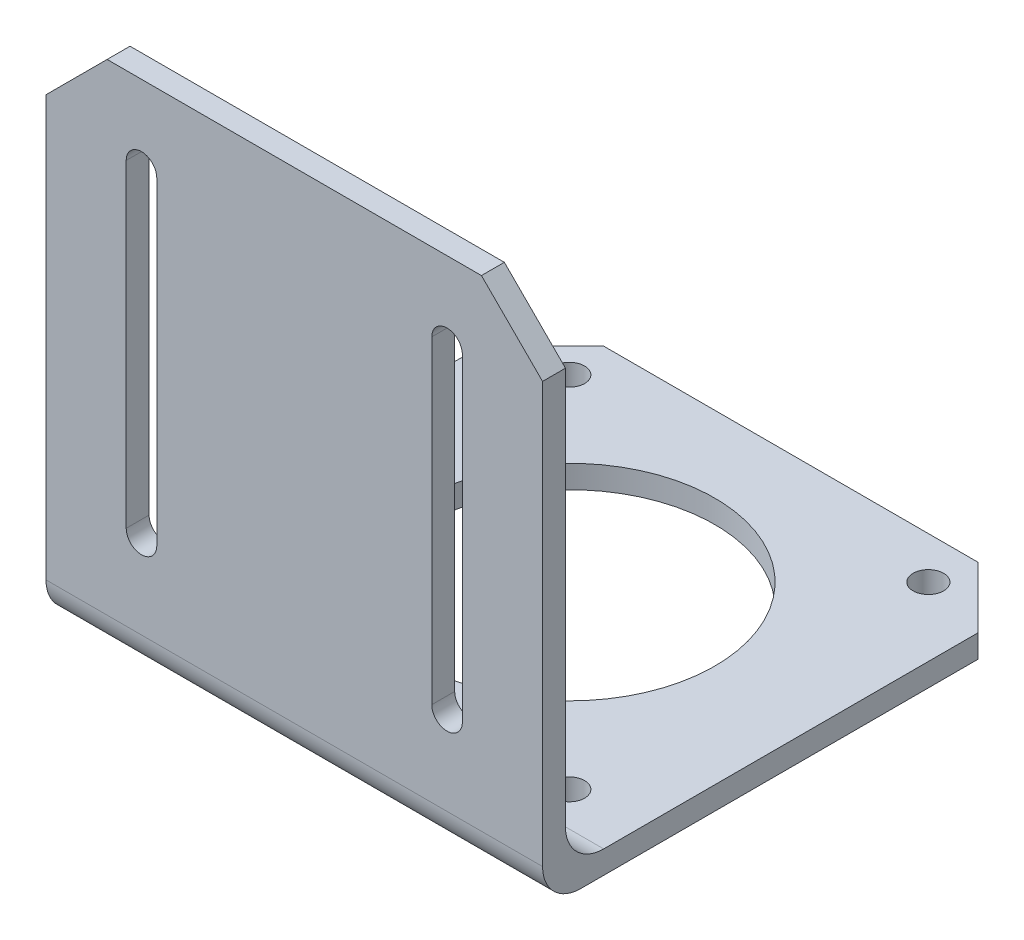
ISO-10303-21;
HEADER;
FILE_DESCRIPTION(('STEP AP214'),'2;1');
FILE_NAME('part.step','',(''),(''),'','','');
FILE_SCHEMA(('AUTOMOTIVE_DESIGN { 1 0 10303 214 1 1 1 1 }'));
ENDSEC;
DATA;
#1=APPLICATION_CONTEXT('core data for automotive mechanical design processes');
#2=APPLICATION_PROTOCOL_DEFINITION('international standard','automotive_design',2000,#1);
#3=PRODUCT_CONTEXT('',#1,'mechanical');
#4=PRODUCT('Part','Part','',(#3));
#5=PRODUCT_RELATED_PRODUCT_CATEGORY('part','',(#4));
#6=PRODUCT_DEFINITION_FORMATION('','',#4);
#7=PRODUCT_DEFINITION_CONTEXT('part definition',#1,'design');
#8=PRODUCT_DEFINITION('design','',#6,#7);
#9=PRODUCT_DEFINITION_SHAPE('','',#8);
#10=(LENGTH_UNIT() NAMED_UNIT(*) SI_UNIT(.MILLI.,.METRE.));
#11=(NAMED_UNIT(*) PLANE_ANGLE_UNIT() SI_UNIT($,.RADIAN.));
#12=(NAMED_UNIT(*) SI_UNIT($,.STERADIAN.) SOLID_ANGLE_UNIT());
#13=UNCERTAINTY_MEASURE_WITH_UNIT(LENGTH_MEASURE(1.E-05),#10,'distance_accuracy_value','');
#14=(GEOMETRIC_REPRESENTATION_CONTEXT(3) GLOBAL_UNCERTAINTY_ASSIGNED_CONTEXT((#13)) GLOBAL_UNIT_ASSIGNED_CONTEXT((#10,
#11,#12)) REPRESENTATION_CONTEXT('',''));
#15=CARTESIAN_POINT('',(0.,0.,0.));
#16=DIRECTION('',(0.,0.,1.));
#17=DIRECTION('',(1.,0.,0.));
#18=AXIS2_PLACEMENT_3D('',#15,#16,#17);
#19=CARTESIAN_POINT('',(0.,3.,0.));
#20=DIRECTION('',(0.,1.,0.));
#21=DIRECTION('',(0.,0.,1.));
#22=AXIS2_PLACEMENT_3D('',#19,#20,#21);
#23=PLANE('',#22);
#24=DIRECTION('',(0.,0.,1.));
#25=VECTOR('',#24,1.);
#26=CARTESIAN_POINT('',(-32.5,3.,-32.5));
#27=LINE('',#26,#25);
#28=CARTESIAN_POINT('',(-32.5,3.,-24.5));
#29=VERTEX_POINT('',#28);
#30=CARTESIAN_POINT('',(-32.5,3.,24.5));
#31=VERTEX_POINT('',#30);
#32=EDGE_CURVE('E285',#29,#31,#27,.T.);
#33=ORIENTED_EDGE('',*,*,#32,.T.);
#34=DIRECTION('',(-1.,0.,0.));
#35=VECTOR('',#34,1.);
#36=CARTESIAN_POINT('',(0.,3.,24.5));
#37=LINE('',#36,#35);
#38=CARTESIAN_POINT('',(32.5,3.,24.5));
#39=VERTEX_POINT('',#38);
#40=EDGE_CURVE('E321',#31,#39,#37,.F.);
#41=ORIENTED_EDGE('',*,*,#40,.T.);
#42=DIRECTION('',(0.,0.,-1.));
#43=VECTOR('',#42,1.);
#44=CARTESIAN_POINT('',(32.5,3.,-32.5));
#45=LINE('',#44,#43);
#46=CARTESIAN_POINT('',(32.5,3.,-24.5));
#47=VERTEX_POINT('',#46);
#48=EDGE_CURVE('E279',#39,#47,#45,.T.);
#49=ORIENTED_EDGE('',*,*,#48,.T.);
#50=DIRECTION('',(0.707106781186546,0.,0.707106781186549));
#51=VECTOR('',#50,1.);
#52=CARTESIAN_POINT('',(28.5000000000001,3.,-28.5));
#53=LINE('',#52,#51);
#54=CARTESIAN_POINT('',(24.5,3.,-32.5));
#55=VERTEX_POINT('',#54);
#56=EDGE_CURVE('E313',#47,#55,#53,.F.);
#57=ORIENTED_EDGE('',*,*,#56,.T.);
#58=DIRECTION('',(-1.,0.,0.));
#59=VECTOR('',#58,1.);
#60=CARTESIAN_POINT('',(-32.5,3.,-32.5));
#61=LINE('',#60,#59);
#62=CARTESIAN_POINT('',(-24.5,3.,-32.5));
#63=VERTEX_POINT('',#62);
#64=EDGE_CURVE('E281',#55,#63,#61,.T.);
#65=ORIENTED_EDGE('',*,*,#64,.T.);
#66=DIRECTION('',(0.707106781186549,0.,-0.707106781186546));
#67=VECTOR('',#66,1.);
#68=CARTESIAN_POINT('',(-28.4999999999999,3.,-28.5));
#69=LINE('',#68,#67);
#70=EDGE_CURVE('E311',#63,#29,#69,.F.);
#71=ORIENTED_EDGE('',*,*,#70,.T.);
#72=EDGE_LOOP('',(#33,#41,#49,#57,#65,#71));
#73=FACE_BOUND('',#72,.T.);
#74=CARTESIAN_POINT('',(23.5,3.,20.));
#75=DIRECTION('',(0.,1.,0.));
#76=DIRECTION('',(0.,0.,1.));
#77=AXIS2_PLACEMENT_3D('',#74,#75,#76);
#78=CIRCLE('',#77,2.);
#79=CARTESIAN_POINT('',(23.5,3.,22.));
#80=VERTEX_POINT('',#79);
#81=EDGE_CURVE('E255',#80,#80,#78,.T.);
#82=ORIENTED_EDGE('',*,*,#81,.F.);
#83=EDGE_LOOP('',(#82));
#84=FACE_BOUND('',#83,.T.);
#85=CARTESIAN_POINT('',(-23.5,3.,-27.));
#86=DIRECTION('',(0.,1.,0.));
#87=DIRECTION('',(0.,0.,1.));
#88=AXIS2_PLACEMENT_3D('',#85,#86,#87);
#89=CIRCLE('',#88,2.);
#90=CARTESIAN_POINT('',(-23.5,3.,-25.));
#91=VERTEX_POINT('',#90);
#92=EDGE_CURVE('E267',#91,#91,#89,.T.);
#93=ORIENTED_EDGE('',*,*,#92,.F.);
#94=EDGE_LOOP('',(#93));
#95=FACE_BOUND('',#94,.T.);
#96=CARTESIAN_POINT('',(0.,3.,-3.5));
#97=DIRECTION('',(0.,1.,0.));
#98=DIRECTION('',(0.,0.,1.));
#99=AXIS2_PLACEMENT_3D('',#96,#97,#98);
#100=CIRCLE('',#99,19.05);
#101=CARTESIAN_POINT('',(0.,3.,15.55));
#102=VERTEX_POINT('',#101);
#103=EDGE_CURVE('E273',#102,#102,#100,.T.);
#104=ORIENTED_EDGE('',*,*,#103,.F.);
#105=EDGE_LOOP('',(#104));
#106=FACE_BOUND('',#105,.T.);
#107=CARTESIAN_POINT('',(-23.5,3.,20.));
#108=DIRECTION('',(0.,1.,0.));
#109=DIRECTION('',(0.,0.,1.));
#110=AXIS2_PLACEMENT_3D('',#107,#108,#109);
#111=CIRCLE('',#110,2.);
#112=CARTESIAN_POINT('',(-23.5,3.,22.));
#113=VERTEX_POINT('',#112);
#114=EDGE_CURVE('E261',#113,#113,#111,.T.);
#115=ORIENTED_EDGE('',*,*,#114,.F.);
#116=EDGE_LOOP('',(#115));
#117=FACE_BOUND('',#116,.T.);
#118=CARTESIAN_POINT('',(23.5,3.,-27.));
#119=DIRECTION('',(0.,1.,0.));
#120=DIRECTION('',(0.,0.,1.));
#121=AXIS2_PLACEMENT_3D('',#118,#119,#120);
#122=CIRCLE('',#121,2.);
#123=CARTESIAN_POINT('',(23.5,3.,-25.));
#124=VERTEX_POINT('',#123);
#125=EDGE_CURVE('E249',#124,#124,#122,.T.);
#126=ORIENTED_EDGE('',*,*,#125,.F.);
#127=EDGE_LOOP('',(#126));
#128=FACE_BOUND('',#127,.T.);
#129=ADVANCED_FACE('F33',(#73,#84,#95,#106,#117,#128),#23,.T.);
#130=CARTESIAN_POINT('',(0.,0.,0.));
#131=DIRECTION('',(0.,1.,0.));
#132=DIRECTION('',(0.,0.,1.));
#133=AXIS2_PLACEMENT_3D('',#130,#131,#132);
#134=PLANE('',#133);
#135=DIRECTION('',(0.,0.,-1.));
#136=VECTOR('',#135,1.);
#137=CARTESIAN_POINT('',(32.5,0.,-32.5));
#138=LINE('',#137,#136);
#139=CARTESIAN_POINT('',(32.5,0.,27.5));
#140=VERTEX_POINT('',#139);
#141=CARTESIAN_POINT('',(32.5,0.,-24.5));
#142=VERTEX_POINT('',#141);
#143=EDGE_CURVE('E276',#140,#142,#138,.T.);
#144=ORIENTED_EDGE('',*,*,#143,.F.);
#145=DIRECTION('',(1.,0.,0.));
#146=VECTOR('',#145,1.);
#147=CARTESIAN_POINT('',(0.,0.,27.5));
#148=LINE('',#147,#146);
#149=CARTESIAN_POINT('',(-32.5,0.,27.5));
#150=VERTEX_POINT('',#149);
#151=EDGE_CURVE('E328',#140,#150,#148,.F.);
#152=ORIENTED_EDGE('',*,*,#151,.T.);
#153=DIRECTION('',(0.,0.,1.));
#154=VECTOR('',#153,1.);
#155=CARTESIAN_POINT('',(-32.5,0.,-32.5));
#156=LINE('',#155,#154);
#157=CARTESIAN_POINT('',(-32.5,0.,-24.5));
#158=VERTEX_POINT('',#157);
#159=EDGE_CURVE('E282',#158,#150,#156,.T.);
#160=ORIENTED_EDGE('',*,*,#159,.F.);
#161=DIRECTION('',(-0.707106781186549,0.,0.707106781186546));
#162=VECTOR('',#161,1.);
#163=CARTESIAN_POINT('',(-32.5,0.,-24.5));
#164=LINE('',#163,#162);
#165=CARTESIAN_POINT('',(-24.5,0.,-32.5));
#166=VERTEX_POINT('',#165);
#167=EDGE_CURVE('E303',#158,#166,#164,.F.);
#168=ORIENTED_EDGE('',*,*,#167,.T.);
#169=DIRECTION('',(-1.,0.,0.));
#170=VECTOR('',#169,1.);
#171=CARTESIAN_POINT('',(-32.5,0.,-32.5));
#172=LINE('',#171,#170);
#173=CARTESIAN_POINT('',(24.5,0.,-32.5));
#174=VERTEX_POINT('',#173);
#175=EDGE_CURVE('E290',#174,#166,#172,.T.);
#176=ORIENTED_EDGE('',*,*,#175,.F.);
#177=DIRECTION('',(-0.707106781186546,0.,-0.707106781186549));
#178=VECTOR('',#177,1.);
#179=CARTESIAN_POINT('',(24.5,0.,-32.5));
#180=LINE('',#179,#178);
#181=EDGE_CURVE('E305',#174,#142,#180,.F.);
#182=ORIENTED_EDGE('',*,*,#181,.T.);
#183=EDGE_LOOP('',(#144,#152,#160,#168,#176,#182));
#184=FACE_BOUND('',#183,.T.);
#185=CARTESIAN_POINT('',(0.,0.,-3.5));
#186=DIRECTION('',(0.,1.,0.));
#187=DIRECTION('',(0.,0.,1.));
#188=AXIS2_PLACEMENT_3D('',#185,#186,#187);
#189=CIRCLE('',#188,19.05);
#190=CARTESIAN_POINT('',(0.,0.,15.55));
#191=VERTEX_POINT('',#190);
#192=EDGE_CURVE('E270',#191,#191,#189,.T.);
#193=ORIENTED_EDGE('',*,*,#192,.T.);
#194=EDGE_LOOP('',(#193));
#195=FACE_BOUND('',#194,.T.);
#196=CARTESIAN_POINT('',(-23.5,0.,-27.));
#197=DIRECTION('',(0.,1.,0.));
#198=DIRECTION('',(0.,0.,1.));
#199=AXIS2_PLACEMENT_3D('',#196,#197,#198);
#200=CIRCLE('',#199,2.);
#201=CARTESIAN_POINT('',(-23.5,0.,-25.));
#202=VERTEX_POINT('',#201);
#203=EDGE_CURVE('E264',#202,#202,#200,.T.);
#204=ORIENTED_EDGE('',*,*,#203,.T.);
#205=EDGE_LOOP('',(#204));
#206=FACE_BOUND('',#205,.T.);
#207=CARTESIAN_POINT('',(-23.5,0.,20.));
#208=DIRECTION('',(0.,1.,0.));
#209=DIRECTION('',(0.,0.,1.));
#210=AXIS2_PLACEMENT_3D('',#207,#208,#209);
#211=CIRCLE('',#210,2.);
#212=CARTESIAN_POINT('',(-23.5,0.,22.));
#213=VERTEX_POINT('',#212);
#214=EDGE_CURVE('E258',#213,#213,#211,.T.);
#215=ORIENTED_EDGE('',*,*,#214,.T.);
#216=EDGE_LOOP('',(#215));
#217=FACE_BOUND('',#216,.T.);
#218=CARTESIAN_POINT('',(23.5,0.,20.));
#219=DIRECTION('',(0.,1.,0.));
#220=DIRECTION('',(0.,0.,1.));
#221=AXIS2_PLACEMENT_3D('',#218,#219,#220);
#222=CIRCLE('',#221,2.);
#223=CARTESIAN_POINT('',(23.5,0.,22.));
#224=VERTEX_POINT('',#223);
#225=EDGE_CURVE('E252',#224,#224,#222,.T.);
#226=ORIENTED_EDGE('',*,*,#225,.T.);
#227=EDGE_LOOP('',(#226));
#228=FACE_BOUND('',#227,.T.);
#229=CARTESIAN_POINT('',(23.5,0.,-27.));
#230=DIRECTION('',(0.,1.,0.));
#231=DIRECTION('',(0.,0.,1.));
#232=AXIS2_PLACEMENT_3D('',#229,#230,#231);
#233=CIRCLE('',#232,2.);
#234=CARTESIAN_POINT('',(23.5,0.,-25.));
#235=VERTEX_POINT('',#234);
#236=EDGE_CURVE('E248',#235,#235,#233,.T.);
#237=ORIENTED_EDGE('',*,*,#236,.T.);
#238=EDGE_LOOP('',(#237));
#239=FACE_BOUND('',#238,.T.);
#240=ADVANCED_FACE('F391',(#184,#195,#206,#217,#228,#239),#134,.F.);
#241=CARTESIAN_POINT('',(32.5,3.,-32.5));
#242=DIRECTION('',(-1.,0.,0.));
#243=DIRECTION('',(0.,0.,1.));
#244=AXIS2_PLACEMENT_3D('',#241,#242,#243);
#245=PLANE('',#244);
#246=DIRECTION('',(0.,-1.,0.));
#247=VECTOR('',#246,1.);
#248=CARTESIAN_POINT('',(32.5,68.,29.5));
#249=LINE('',#248,#247);
#250=CARTESIAN_POINT('',(32.5,60.,29.5));
#251=VERTEX_POINT('',#250);
#252=CARTESIAN_POINT('',(32.5,8.,29.5));
#253=VERTEX_POINT('',#252);
#254=EDGE_CURVE('E246',#251,#253,#249,.T.);
#255=ORIENTED_EDGE('',*,*,#254,.F.);
#256=DIRECTION('',(0.,0.,1.));
#257=VECTOR('',#256,1.);
#258=CARTESIAN_POINT('',(32.5,60.,-32.5));
#259=LINE('',#258,#257);
#260=CARTESIAN_POINT('',(32.5,60.,32.5));
#261=VERTEX_POINT('',#260);
#262=EDGE_CURVE('E348',#251,#261,#259,.T.);
#263=ORIENTED_EDGE('',*,*,#262,.T.);
#264=DIRECTION('',(0.,-1.,0.));
#265=VECTOR('',#264,1.);
#266=CARTESIAN_POINT('',(32.5,3.,32.5));
#267=LINE('',#266,#265);
#268=CARTESIAN_POINT('',(32.5,5.,32.5));
#269=VERTEX_POINT('',#268);
#270=EDGE_CURVE('E288',#261,#269,#267,.T.);
#271=ORIENTED_EDGE('',*,*,#270,.T.);
#272=CARTESIAN_POINT('',(32.5,5.,27.5));
#273=DIRECTION('',(-1.,0.,0.));
#274=DIRECTION('',(0.,0.,1.));
#275=AXIS2_PLACEMENT_3D('',#272,#273,#274);
#276=CIRCLE('',#275,5.);
#277=EDGE_CURVE('E326',#269,#140,#276,.F.);
#278=ORIENTED_EDGE('',*,*,#277,.T.);
#279=ORIENTED_EDGE('',*,*,#143,.T.);
#280=DIRECTION('',(0.,1.,0.));
#281=VECTOR('',#280,1.);
#282=CARTESIAN_POINT('',(32.5,3.,-24.5));
#283=LINE('',#282,#281);
#284=EDGE_CURVE('E308',#142,#47,#283,.T.);
#285=ORIENTED_EDGE('',*,*,#284,.T.);
#286=ORIENTED_EDGE('',*,*,#48,.F.);
#287=CARTESIAN_POINT('',(32.5,8.,24.5));
#288=DIRECTION('',(-1.,0.,0.));
#289=DIRECTION('',(0.,0.,1.));
#290=AXIS2_PLACEMENT_3D('',#287,#288,#289);
#291=CIRCLE('',#290,5.);
#292=EDGE_CURVE('E335',#39,#253,#291,.T.);
#293=ORIENTED_EDGE('',*,*,#292,.T.);
#294=EDGE_LOOP('',(#255,#263,#271,#278,#279,#285,#286,#293));
#295=FACE_BOUND('',#294,.T.);
#296=ADVANCED_FACE('F367',(#295),#245,.F.);
#297=CARTESIAN_POINT('',(-32.5,3.,-32.5));
#298=DIRECTION('',(0.,0.,1.));
#299=DIRECTION('',(1.,0.,0.));
#300=AXIS2_PLACEMENT_3D('',#297,#298,#299);
#301=PLANE('',#300);
#302=ORIENTED_EDGE('',*,*,#64,.F.);
#303=DIRECTION('',(0.,-1.,0.));
#304=VECTOR('',#303,1.);
#305=CARTESIAN_POINT('',(24.5,3.,-32.5));
#306=LINE('',#305,#304);
#307=EDGE_CURVE('E300',#55,#174,#306,.T.);
#308=ORIENTED_EDGE('',*,*,#307,.T.);
#309=ORIENTED_EDGE('',*,*,#175,.T.);
#310=DIRECTION('',(0.,1.,0.));
#311=VECTOR('',#310,1.);
#312=CARTESIAN_POINT('',(-24.5,3.,-32.5));
#313=LINE('',#312,#311);
#314=EDGE_CURVE('E298',#166,#63,#313,.T.);
#315=ORIENTED_EDGE('',*,*,#314,.T.);
#316=EDGE_LOOP('',(#302,#308,#309,#315));
#317=FACE_BOUND('',#316,.T.);
#318=ADVANCED_FACE('F404',(#317),#301,.F.);
#319=CARTESIAN_POINT('',(-32.5,3.,-32.5));
#320=DIRECTION('',(1.,0.,0.));
#321=DIRECTION('',(0.,0.,-1.));
#322=AXIS2_PLACEMENT_3D('',#319,#320,#321);
#323=PLANE('',#322);
#324=DIRECTION('',(0.,-1.,0.));
#325=VECTOR('',#324,1.);
#326=CARTESIAN_POINT('',(-32.5,3.,32.5));
#327=LINE('',#326,#325);
#328=CARTESIAN_POINT('',(-32.5,60.,32.5));
#329=VERTEX_POINT('',#328);
#330=CARTESIAN_POINT('',(-32.5,5.,32.5));
#331=VERTEX_POINT('',#330);
#332=EDGE_CURVE('E296',#329,#331,#327,.T.);
#333=ORIENTED_EDGE('',*,*,#332,.F.);
#334=DIRECTION('',(0.,0.,-1.));
#335=VECTOR('',#334,1.);
#336=CARTESIAN_POINT('',(-32.5,60.,-32.5));
#337=LINE('',#336,#335);
#338=CARTESIAN_POINT('',(-32.5,60.,29.5));
#339=VERTEX_POINT('',#338);
#340=EDGE_CURVE('E11',#329,#339,#337,.T.);
#341=ORIENTED_EDGE('',*,*,#340,.T.);
#342=DIRECTION('',(0.,-1.,0.));
#343=VECTOR('',#342,1.);
#344=CARTESIAN_POINT('',(-32.5,68.,29.5));
#345=LINE('',#344,#343);
#346=CARTESIAN_POINT('',(-32.5,8.,29.5));
#347=VERTEX_POINT('',#346);
#348=EDGE_CURVE('E244',#339,#347,#345,.T.);
#349=ORIENTED_EDGE('',*,*,#348,.T.);
#350=CARTESIAN_POINT('',(-32.5,8.,24.5));
#351=DIRECTION('',(1.,0.,0.));
#352=DIRECTION('',(0.,0.,-1.));
#353=AXIS2_PLACEMENT_3D('',#350,#351,#352);
#354=CIRCLE('',#353,5.);
#355=EDGE_CURVE('E333',#347,#31,#354,.T.);
#356=ORIENTED_EDGE('',*,*,#355,.T.);
#357=ORIENTED_EDGE('',*,*,#32,.F.);
#358=DIRECTION('',(0.,-1.,0.));
#359=VECTOR('',#358,1.);
#360=CARTESIAN_POINT('',(-32.5,3.,-24.5));
#361=LINE('',#360,#359);
#362=EDGE_CURVE('E315',#29,#158,#361,.T.);
#363=ORIENTED_EDGE('',*,*,#362,.T.);
#364=ORIENTED_EDGE('',*,*,#159,.T.);
#365=CARTESIAN_POINT('',(-32.5,5.,27.5));
#366=DIRECTION('',(1.,0.,0.));
#367=DIRECTION('',(0.,0.,-1.));
#368=AXIS2_PLACEMENT_3D('',#365,#366,#367);
#369=CIRCLE('',#368,5.);
#370=EDGE_CURVE('E330',#150,#331,#369,.F.);
#371=ORIENTED_EDGE('',*,*,#370,.T.);
#372=EDGE_LOOP('',(#333,#341,#349,#356,#357,#363,#364,#371));
#373=FACE_BOUND('',#372,.T.);
#374=ADVANCED_FACE('F381',(#373),#323,.F.);
#375=CARTESIAN_POINT('',(-32.5,3.,32.5));
#376=DIRECTION('',(0.,0.,-1.));
#377=DIRECTION('',(-1.,0.,0.));
#378=AXIS2_PLACEMENT_3D('',#375,#376,#377);
#379=PLANE('',#378);
#380=DIRECTION('',(0.,1.,0.));
#381=VECTOR('',#380,1.);
#382=CARTESIAN_POINT('',(-22.,2.99999999999999,32.5));
#383=LINE('',#382,#381);
#384=CARTESIAN_POINT('',(-22.,16.1,32.5));
#385=VERTEX_POINT('',#384);
#386=CARTESIAN_POINT('',(-22.,57.8,32.5));
#387=VERTEX_POINT('',#386);
#388=EDGE_CURVE('E200',#385,#387,#383,.T.);
#389=ORIENTED_EDGE('',*,*,#388,.T.);
#390=CARTESIAN_POINT('',(-20.,57.8,32.5));
#391=DIRECTION('',(0.,0.,-1.));
#392=DIRECTION('',(-1.,0.,0.));
#393=AXIS2_PLACEMENT_3D('',#390,#391,#392);
#394=CIRCLE('',#393,2.);
#395=CARTESIAN_POINT('',(-18.,57.8,32.5));
#396=VERTEX_POINT('',#395);
#397=EDGE_CURVE('E203',#387,#396,#394,.T.);
#398=ORIENTED_EDGE('',*,*,#397,.T.);
#399=DIRECTION('',(0.,-1.,0.));
#400=VECTOR('',#399,1.);
#401=CARTESIAN_POINT('',(-18.,2.99999999999999,32.5));
#402=LINE('',#401,#400);
#403=CARTESIAN_POINT('',(-18.,16.1,32.5));
#404=VERTEX_POINT('',#403);
#405=EDGE_CURVE('E195',#396,#404,#402,.T.);
#406=ORIENTED_EDGE('',*,*,#405,.T.);
#407=CARTESIAN_POINT('',(-20.,16.1,32.5));
#408=DIRECTION('',(0.,0.,-1.));
#409=DIRECTION('',(-1.,0.,0.));
#410=AXIS2_PLACEMENT_3D('',#407,#408,#409);
#411=CIRCLE('',#410,2.00000000000001);
#412=EDGE_CURVE('E175',#404,#385,#411,.T.);
#413=ORIENTED_EDGE('',*,*,#412,.T.);
#414=EDGE_LOOP('',(#389,#398,#406,#413));
#415=FACE_BOUND('',#414,.T.);
#416=DIRECTION('',(0.,1.,0.));
#417=VECTOR('',#416,1.);
#418=CARTESIAN_POINT('',(18.,2.99999999999998,32.5));
#419=LINE('',#418,#417);
#420=CARTESIAN_POINT('',(18.,16.1,32.5));
#421=VERTEX_POINT('',#420);
#422=CARTESIAN_POINT('',(18.,57.8,32.5));
#423=VERTEX_POINT('',#422);
#424=EDGE_CURVE('E232',#421,#423,#419,.T.);
#425=ORIENTED_EDGE('',*,*,#424,.T.);
#426=CARTESIAN_POINT('',(20.,57.8,32.5));
#427=DIRECTION('',(0.,0.,-1.));
#428=DIRECTION('',(-1.,0.,0.));
#429=AXIS2_PLACEMENT_3D('',#426,#427,#428);
#430=CIRCLE('',#429,2.);
#431=CARTESIAN_POINT('',(22.,57.8,32.5));
#432=VERTEX_POINT('',#431);
#433=EDGE_CURVE('E235',#423,#432,#430,.T.);
#434=ORIENTED_EDGE('',*,*,#433,.T.);
#435=DIRECTION('',(0.,-1.,0.));
#436=VECTOR('',#435,1.);
#437=CARTESIAN_POINT('',(22.,2.99999999999999,32.5));
#438=LINE('',#437,#436);
#439=CARTESIAN_POINT('',(22.,16.1,32.5));
#440=VERTEX_POINT('',#439);
#441=EDGE_CURVE('E220',#432,#440,#438,.T.);
#442=ORIENTED_EDGE('',*,*,#441,.T.);
#443=CARTESIAN_POINT('',(20.,16.1,32.5));
#444=DIRECTION('',(0.,0.,-1.));
#445=DIRECTION('',(-1.,0.,0.));
#446=AXIS2_PLACEMENT_3D('',#443,#444,#445);
#447=CIRCLE('',#446,2.00000000000001);
#448=EDGE_CURVE('E229',#440,#421,#447,.T.);
#449=ORIENTED_EDGE('',*,*,#448,.T.);
#450=EDGE_LOOP('',(#425,#434,#442,#449));
#451=FACE_BOUND('',#450,.T.);
#452=ORIENTED_EDGE('',*,*,#270,.F.);
#453=DIRECTION('',(0.707106781186546,-0.707106781186549,0.));
#454=VECTOR('',#453,1.);
#455=CARTESIAN_POINT('',(24.5,68.,32.5));
#456=LINE('',#455,#454);
#457=CARTESIAN_POINT('',(24.5,68.,32.5));
#458=VERTEX_POINT('',#457);
#459=EDGE_CURVE('E41',#261,#458,#456,.F.);
#460=ORIENTED_EDGE('',*,*,#459,.T.);
#461=DIRECTION('',(1.,0.,0.));
#462=VECTOR('',#461,1.);
#463=CARTESIAN_POINT('',(-32.5,68.,32.5));
#464=LINE('',#463,#462);
#465=CARTESIAN_POINT('',(-24.5,68.,32.5));
#466=VERTEX_POINT('',#465);
#467=EDGE_CURVE('E238',#466,#458,#464,.T.);
#468=ORIENTED_EDGE('',*,*,#467,.F.);
#469=DIRECTION('',(0.707106781186546,0.707106781186549,0.));
#470=VECTOR('',#469,1.);
#471=CARTESIAN_POINT('',(-24.5,68.,32.5));
#472=LINE('',#471,#470);
#473=EDGE_CURVE('E350',#466,#329,#472,.F.);
#474=ORIENTED_EDGE('',*,*,#473,.T.);
#475=ORIENTED_EDGE('',*,*,#332,.T.);
#476=DIRECTION('',(1.,0.,0.));
#477=VECTOR('',#476,1.);
#478=CARTESIAN_POINT('',(-32.5,5.,32.5));
#479=LINE('',#478,#477);
#480=EDGE_CURVE('E323',#331,#269,#479,.T.);
#481=ORIENTED_EDGE('',*,*,#480,.T.);
#482=EDGE_LOOP('',(#452,#460,#468,#474,#475,#481));
#483=FACE_BOUND('',#482,.T.);
#484=ADVANCED_FACE('F355',(#415,#451,#483),#379,.F.);
#485=CARTESIAN_POINT('',(0.,3.,-3.5));
#486=DIRECTION('',(0.,-1.,0.));
#487=DIRECTION('',(0.,0.,-1.));
#488=AXIS2_PLACEMENT_3D('',#485,#486,#487);
#489=CYLINDRICAL_SURFACE('',#488,19.05);
#490=ORIENTED_EDGE('',*,*,#103,.T.);
#491=EDGE_LOOP('',(#490));
#492=FACE_BOUND('',#491,.T.);
#493=ORIENTED_EDGE('',*,*,#192,.F.);
#494=EDGE_LOOP('',(#493));
#495=FACE_BOUND('',#494,.T.);
#496=ADVANCED_FACE('F427',(#492,#495),#489,.F.);
#497=CARTESIAN_POINT('',(-23.5,3.,-27.));
#498=DIRECTION('',(0.,-1.,0.));
#499=DIRECTION('',(0.,0.,-1.));
#500=AXIS2_PLACEMENT_3D('',#497,#498,#499);
#501=CYLINDRICAL_SURFACE('',#500,2.);
#502=ORIENTED_EDGE('',*,*,#92,.T.);
#503=EDGE_LOOP('',(#502));
#504=FACE_BOUND('',#503,.T.);
#505=ORIENTED_EDGE('',*,*,#203,.F.);
#506=EDGE_LOOP('',(#505));
#507=FACE_BOUND('',#506,.T.);
#508=ADVANCED_FACE('F466',(#504,#507),#501,.F.);
#509=CARTESIAN_POINT('',(-23.5,3.,20.));
#510=DIRECTION('',(0.,-1.,0.));
#511=DIRECTION('',(0.,0.,-1.));
#512=AXIS2_PLACEMENT_3D('',#509,#510,#511);
#513=CYLINDRICAL_SURFACE('',#512,2.);
#514=ORIENTED_EDGE('',*,*,#114,.T.);
#515=EDGE_LOOP('',(#514));
#516=FACE_BOUND('',#515,.T.);
#517=ORIENTED_EDGE('',*,*,#214,.F.);
#518=EDGE_LOOP('',(#517));
#519=FACE_BOUND('',#518,.T.);
#520=ADVANCED_FACE('F473',(#516,#519),#513,.F.);
#521=CARTESIAN_POINT('',(23.5,3.,20.));
#522=DIRECTION('',(0.,-1.,0.));
#523=DIRECTION('',(0.,0.,-1.));
#524=AXIS2_PLACEMENT_3D('',#521,#522,#523);
#525=CYLINDRICAL_SURFACE('',#524,2.);
#526=ORIENTED_EDGE('',*,*,#81,.T.);
#527=EDGE_LOOP('',(#526));
#528=FACE_BOUND('',#527,.T.);
#529=ORIENTED_EDGE('',*,*,#225,.F.);
#530=EDGE_LOOP('',(#529));
#531=FACE_BOUND('',#530,.T.);
#532=ADVANCED_FACE('F480',(#528,#531),#525,.F.);
#533=CARTESIAN_POINT('',(23.5,3.,-27.));
#534=DIRECTION('',(0.,-1.,0.));
#535=DIRECTION('',(0.,0.,-1.));
#536=AXIS2_PLACEMENT_3D('',#533,#534,#535);
#537=CYLINDRICAL_SURFACE('',#536,2.);
#538=ORIENTED_EDGE('',*,*,#125,.T.);
#539=EDGE_LOOP('',(#538));
#540=FACE_BOUND('',#539,.T.);
#541=ORIENTED_EDGE('',*,*,#236,.F.);
#542=EDGE_LOOP('',(#541));
#543=FACE_BOUND('',#542,.T.);
#544=ADVANCED_FACE('F417',(#540,#543),#537,.F.);
#545=CARTESIAN_POINT('',(24.5,3.,-32.5));
#546=DIRECTION('',(-0.707106781186549,0.,0.707106781186546));
#547=DIRECTION('',(0.,-1.,0.));
#548=AXIS2_PLACEMENT_3D('',#545,#546,#547);
#549=PLANE('',#548);
#550=ORIENTED_EDGE('',*,*,#56,.F.);
#551=ORIENTED_EDGE('',*,*,#284,.F.);
#552=ORIENTED_EDGE('',*,*,#181,.F.);
#553=ORIENTED_EDGE('',*,*,#307,.F.);
#554=EDGE_LOOP('',(#550,#551,#552,#553));
#555=FACE_BOUND('',#554,.T.);
#556=ADVANCED_FACE('F398',(#555),#549,.F.);
#557=CARTESIAN_POINT('',(-32.5,3.,-24.5));
#558=DIRECTION('',(0.707106781186546,0.,0.707106781186549));
#559=DIRECTION('',(0.,-1.,0.));
#560=AXIS2_PLACEMENT_3D('',#557,#558,#559);
#561=PLANE('',#560);
#562=ORIENTED_EDGE('',*,*,#70,.F.);
#563=ORIENTED_EDGE('',*,*,#314,.F.);
#564=ORIENTED_EDGE('',*,*,#167,.F.);
#565=ORIENTED_EDGE('',*,*,#362,.F.);
#566=EDGE_LOOP('',(#562,#563,#564,#565));
#567=FACE_BOUND('',#566,.T.);
#568=ADVANCED_FACE('F407',(#567),#561,.F.);
#569=CARTESIAN_POINT('',(-32.5,68.,29.5));
#570=DIRECTION('',(0.,0.,1.));
#571=DIRECTION('',(1.,0.,0.));
#572=AXIS2_PLACEMENT_3D('',#569,#570,#571);
#573=PLANE('',#572);
#574=DIRECTION('',(0.,-1.,0.));
#575=VECTOR('',#574,1.);
#576=CARTESIAN_POINT('',(-18.,57.8,29.5));
#577=LINE('',#576,#575);
#578=CARTESIAN_POINT('',(-18.,57.8,29.5));
#579=VERTEX_POINT('',#578);
#580=CARTESIAN_POINT('',(-18.,16.1,29.5));
#581=VERTEX_POINT('',#580);
#582=EDGE_CURVE('E181',#579,#581,#577,.T.);
#583=ORIENTED_EDGE('',*,*,#582,.F.);
#584=CARTESIAN_POINT('',(-20.,57.8,29.5));
#585=DIRECTION('',(0.,0.,-1.));
#586=DIRECTION('',(1.,0.,0.));
#587=AXIS2_PLACEMENT_3D('',#584,#585,#586);
#588=CIRCLE('',#587,2.);
#589=CARTESIAN_POINT('',(-22.,57.8,29.5));
#590=VERTEX_POINT('',#589);
#591=EDGE_CURVE('E56',#590,#579,#588,.T.);
#592=ORIENTED_EDGE('',*,*,#591,.F.);
#593=DIRECTION('',(0.,1.,0.));
#594=VECTOR('',#593,1.);
#595=CARTESIAN_POINT('',(-22.,57.8,29.5));
#596=LINE('',#595,#594);
#597=CARTESIAN_POINT('',(-22.,16.1,29.5));
#598=VERTEX_POINT('',#597);
#599=EDGE_CURVE('E188',#598,#590,#596,.T.);
#600=ORIENTED_EDGE('',*,*,#599,.F.);
#601=CARTESIAN_POINT('',(-20.,16.1,29.5));
#602=DIRECTION('',(0.,0.,-1.));
#603=DIRECTION('',(1.,0.,0.));
#604=AXIS2_PLACEMENT_3D('',#601,#602,#603);
#605=CIRCLE('',#604,2.00000000000001);
#606=EDGE_CURVE('E172',#581,#598,#605,.T.);
#607=ORIENTED_EDGE('',*,*,#606,.F.);
#608=EDGE_LOOP('',(#583,#592,#600,#607));
#609=FACE_BOUND('',#608,.T.);
#610=DIRECTION('',(0.,-1.,0.));
#611=VECTOR('',#610,1.);
#612=CARTESIAN_POINT('',(22.,57.8,29.5));
#613=LINE('',#612,#611);
#614=CARTESIAN_POINT('',(22.,57.8,29.5));
#615=VERTEX_POINT('',#614);
#616=CARTESIAN_POINT('',(22.,16.1,29.5));
#617=VERTEX_POINT('',#616);
#618=EDGE_CURVE('E208',#615,#617,#613,.T.);
#619=ORIENTED_EDGE('',*,*,#618,.F.);
#620=CARTESIAN_POINT('',(20.,57.8,29.5));
#621=DIRECTION('',(0.,0.,-1.));
#622=DIRECTION('',(-1.,0.,0.));
#623=AXIS2_PLACEMENT_3D('',#620,#621,#622);
#624=CIRCLE('',#623,2.);
#625=CARTESIAN_POINT('',(18.,57.8,29.5));
#626=VERTEX_POINT('',#625);
#627=EDGE_CURVE('E206',#626,#615,#624,.T.);
#628=ORIENTED_EDGE('',*,*,#627,.F.);
#629=DIRECTION('',(0.,1.,0.));
#630=VECTOR('',#629,1.);
#631=CARTESIAN_POINT('',(18.,57.8,29.5));
#632=LINE('',#631,#630);
#633=CARTESIAN_POINT('',(18.,16.1,29.5));
#634=VERTEX_POINT('',#633);
#635=EDGE_CURVE('E214',#634,#626,#632,.T.);
#636=ORIENTED_EDGE('',*,*,#635,.F.);
#637=CARTESIAN_POINT('',(20.,16.1,29.5));
#638=DIRECTION('',(0.,0.,-1.));
#639=DIRECTION('',(-1.,0.,0.));
#640=AXIS2_PLACEMENT_3D('',#637,#638,#639);
#641=CIRCLE('',#640,2.00000000000001);
#642=EDGE_CURVE('E211',#617,#634,#641,.T.);
#643=ORIENTED_EDGE('',*,*,#642,.F.);
#644=EDGE_LOOP('',(#619,#628,#636,#643));
#645=FACE_BOUND('',#644,.T.);
#646=DIRECTION('',(-1.,0.,0.));
#647=VECTOR('',#646,1.);
#648=CARTESIAN_POINT('',(-32.5,68.,29.5));
#649=LINE('',#648,#647);
#650=CARTESIAN_POINT('',(24.5,68.,29.5));
#651=VERTEX_POINT('',#650);
#652=CARTESIAN_POINT('',(-24.5,68.,29.5));
#653=VERTEX_POINT('',#652);
#654=EDGE_CURVE('E241',#651,#653,#649,.T.);
#655=ORIENTED_EDGE('',*,*,#654,.F.);
#656=DIRECTION('',(-0.707106781186546,0.707106781186549,0.));
#657=VECTOR('',#656,1.);
#658=CARTESIAN_POINT('',(24.5,68.,29.5));
#659=LINE('',#658,#657);
#660=EDGE_CURVE('E346',#651,#251,#659,.F.);
#661=ORIENTED_EDGE('',*,*,#660,.T.);
#662=ORIENTED_EDGE('',*,*,#254,.T.);
#663=DIRECTION('',(-1.,0.,0.));
#664=VECTOR('',#663,1.);
#665=CARTESIAN_POINT('',(-32.5,8.,29.5));
#666=LINE('',#665,#664);
#667=EDGE_CURVE('E318',#253,#347,#666,.T.);
#668=ORIENTED_EDGE('',*,*,#667,.T.);
#669=ORIENTED_EDGE('',*,*,#348,.F.);
#670=DIRECTION('',(-0.707106781186546,-0.707106781186549,0.));
#671=VECTOR('',#670,1.);
#672=CARTESIAN_POINT('',(-24.5,68.,29.5));
#673=LINE('',#672,#671);
#674=EDGE_CURVE('E344',#339,#653,#673,.F.);
#675=ORIENTED_EDGE('',*,*,#674,.T.);
#676=EDGE_LOOP('',(#655,#661,#662,#668,#669,#675));
#677=FACE_BOUND('',#676,.T.);
#678=ADVANCED_FACE('F185',(#609,#645,#677),#573,.F.);
#679=CARTESIAN_POINT('',(0.,68.,0.));
#680=DIRECTION('',(0.,-1.,0.));
#681=DIRECTION('',(0.,0.,-1.));
#682=AXIS2_PLACEMENT_3D('',#679,#680,#681);
#683=PLANE('',#682);
#684=ORIENTED_EDGE('',*,*,#467,.T.);
#685=DIRECTION('',(0.,0.,-1.));
#686=VECTOR('',#685,1.);
#687=CARTESIAN_POINT('',(24.5,68.,0.));
#688=LINE('',#687,#686);
#689=EDGE_CURVE('E341',#458,#651,#688,.T.);
#690=ORIENTED_EDGE('',*,*,#689,.T.);
#691=ORIENTED_EDGE('',*,*,#654,.T.);
#692=DIRECTION('',(0.,0.,1.));
#693=VECTOR('',#692,1.);
#694=CARTESIAN_POINT('',(-24.5,68.,0.));
#695=LINE('',#694,#693);
#696=EDGE_CURVE('E338',#653,#466,#695,.T.);
#697=ORIENTED_EDGE('',*,*,#696,.T.);
#698=EDGE_LOOP('',(#684,#690,#691,#697));
#699=FACE_BOUND('',#698,.T.);
#700=ADVANCED_FACE('F360',(#699),#683,.F.);
#701=CARTESIAN_POINT('',(-32.5,8.,24.5));
#702=DIRECTION('',(-1.,0.,0.));
#703=DIRECTION('',(0.,0.,1.));
#704=AXIS2_PLACEMENT_3D('',#701,#702,#703);
#705=CYLINDRICAL_SURFACE('',#704,5.);
#706=ORIENTED_EDGE('',*,*,#292,.F.);
#707=ORIENTED_EDGE('',*,*,#40,.F.);
#708=ORIENTED_EDGE('',*,*,#355,.F.);
#709=ORIENTED_EDGE('',*,*,#667,.F.);
#710=EDGE_LOOP('',(#706,#707,#708,#709));
#711=FACE_BOUND('',#710,.T.);
#712=ADVANCED_FACE('F374',(#711),#705,.F.);
#713=CARTESIAN_POINT('',(-32.5,5.,27.5));
#714=DIRECTION('',(1.,0.,0.));
#715=DIRECTION('',(0.,0.,-1.));
#716=AXIS2_PLACEMENT_3D('',#713,#714,#715);
#717=CYLINDRICAL_SURFACE('',#716,5.);
#718=ORIENTED_EDGE('',*,*,#370,.F.);
#719=ORIENTED_EDGE('',*,*,#151,.F.);
#720=ORIENTED_EDGE('',*,*,#277,.F.);
#721=ORIENTED_EDGE('',*,*,#480,.F.);
#722=EDGE_LOOP('',(#718,#719,#720,#721));
#723=FACE_BOUND('',#722,.T.);
#724=ADVANCED_FACE('F388',(#723),#717,.T.);
#725=CARTESIAN_POINT('',(24.5,68.,0.));
#726=DIRECTION('',(-0.707106781186549,-0.707106781186546,0.));
#727=DIRECTION('',(0.,0.,-1.));
#728=AXIS2_PLACEMENT_3D('',#725,#726,#727);
#729=PLANE('',#728);
#730=ORIENTED_EDGE('',*,*,#459,.F.);
#731=ORIENTED_EDGE('',*,*,#262,.F.);
#732=ORIENTED_EDGE('',*,*,#660,.F.);
#733=ORIENTED_EDGE('',*,*,#689,.F.);
#734=EDGE_LOOP('',(#730,#731,#732,#733));
#735=FACE_BOUND('',#734,.T.);
#736=ADVANCED_FACE('F363',(#735),#729,.F.);
#737=CARTESIAN_POINT('',(-24.5,68.,0.));
#738=DIRECTION('',(0.707106781186549,-0.707106781186546,0.));
#739=DIRECTION('',(0.,0.,1.));
#740=AXIS2_PLACEMENT_3D('',#737,#738,#739);
#741=PLANE('',#740);
#742=ORIENTED_EDGE('',*,*,#674,.F.);
#743=ORIENTED_EDGE('',*,*,#340,.F.);
#744=ORIENTED_EDGE('',*,*,#473,.F.);
#745=ORIENTED_EDGE('',*,*,#696,.F.);
#746=EDGE_LOOP('',(#742,#743,#744,#745));
#747=FACE_BOUND('',#746,.T.);
#748=ADVANCED_FACE('F35',(#747),#741,.F.);
#749=CARTESIAN_POINT('',(20.,57.8,94.5));
#750=DIRECTION('',(0.,0.,-1.));
#751=DIRECTION('',(-1.,0.,0.));
#752=AXIS2_PLACEMENT_3D('',#749,#750,#751);
#753=CYLINDRICAL_SURFACE('',#752,2.);
#754=DIRECTION('',(0.,0.,-1.));
#755=VECTOR('',#754,1.);
#756=CARTESIAN_POINT('',(18.,57.8,94.5));
#757=LINE('',#756,#755);
#758=EDGE_CURVE('E218',#423,#626,#757,.T.);
#759=ORIENTED_EDGE('',*,*,#758,.T.);
#760=ORIENTED_EDGE('',*,*,#627,.T.);
#761=DIRECTION('',(0.,0.,-1.));
#762=VECTOR('',#761,1.);
#763=CARTESIAN_POINT('',(22.,57.8,94.5));
#764=LINE('',#763,#762);
#765=EDGE_CURVE('E217',#432,#615,#764,.T.);
#766=ORIENTED_EDGE('',*,*,#765,.F.);
#767=ORIENTED_EDGE('',*,*,#433,.F.);
#768=EDGE_LOOP('',(#759,#760,#766,#767));
#769=FACE_BOUND('',#768,.T.);
#770=ADVANCED_FACE('F539',(#769),#753,.F.);
#771=CARTESIAN_POINT('',(18.,57.8,94.5));
#772=DIRECTION('',(-1.,0.,0.));
#773=DIRECTION('',(0.,-1.,0.));
#774=AXIS2_PLACEMENT_3D('',#771,#772,#773);
#775=PLANE('',#774);
#776=DIRECTION('',(0.,0.,-1.));
#777=VECTOR('',#776,1.);
#778=CARTESIAN_POINT('',(18.,16.1,94.5));
#779=LINE('',#778,#777);
#780=EDGE_CURVE('E221',#421,#634,#779,.T.);
#781=ORIENTED_EDGE('',*,*,#780,.T.);
#782=ORIENTED_EDGE('',*,*,#635,.T.);
#783=ORIENTED_EDGE('',*,*,#758,.F.);
#784=ORIENTED_EDGE('',*,*,#424,.F.);
#785=EDGE_LOOP('',(#781,#782,#783,#784));
#786=FACE_BOUND('',#785,.T.);
#787=ADVANCED_FACE('F545',(#786),#775,.F.);
#788=CARTESIAN_POINT('',(20.,16.1,94.5));
#789=DIRECTION('',(0.,0.,-1.));
#790=DIRECTION('',(-1.,0.,0.));
#791=AXIS2_PLACEMENT_3D('',#788,#789,#790);
#792=CYLINDRICAL_SURFACE('',#791,2.00000000000001);
#793=DIRECTION('',(0.,0.,-1.));
#794=VECTOR('',#793,1.);
#795=CARTESIAN_POINT('',(22.,16.1,94.5));
#796=LINE('',#795,#794);
#797=EDGE_CURVE('E223',#440,#617,#796,.T.);
#798=ORIENTED_EDGE('',*,*,#797,.T.);
#799=ORIENTED_EDGE('',*,*,#642,.T.);
#800=ORIENTED_EDGE('',*,*,#780,.F.);
#801=ORIENTED_EDGE('',*,*,#448,.F.);
#802=EDGE_LOOP('',(#798,#799,#800,#801));
#803=FACE_BOUND('',#802,.T.);
#804=ADVANCED_FACE('F553',(#803),#792,.F.);
#805=CARTESIAN_POINT('',(22.,57.8,94.5));
#806=DIRECTION('',(1.,0.,0.));
#807=DIRECTION('',(0.,1.,0.));
#808=AXIS2_PLACEMENT_3D('',#805,#806,#807);
#809=PLANE('',#808);
#810=ORIENTED_EDGE('',*,*,#765,.T.);
#811=ORIENTED_EDGE('',*,*,#618,.T.);
#812=ORIENTED_EDGE('',*,*,#797,.F.);
#813=ORIENTED_EDGE('',*,*,#441,.F.);
#814=EDGE_LOOP('',(#810,#811,#812,#813));
#815=FACE_BOUND('',#814,.T.);
#816=ADVANCED_FACE('F561',(#815),#809,.F.);
#817=CARTESIAN_POINT('',(-20.,57.8,94.5));
#818=DIRECTION('',(0.,0.,-1.));
#819=DIRECTION('',(-1.,0.,0.));
#820=AXIS2_PLACEMENT_3D('',#817,#818,#819);
#821=CYLINDRICAL_SURFACE('',#820,2.);
#822=DIRECTION('',(0.,0.,-1.));
#823=VECTOR('',#822,1.);
#824=CARTESIAN_POINT('',(-22.,57.8,94.5));
#825=LINE('',#824,#823);
#826=EDGE_CURVE('E193',#387,#590,#825,.T.);
#827=ORIENTED_EDGE('',*,*,#826,.T.);
#828=ORIENTED_EDGE('',*,*,#591,.T.);
#829=DIRECTION('',(0.,0.,-1.));
#830=VECTOR('',#829,1.);
#831=CARTESIAN_POINT('',(-18.,57.8,94.5));
#832=LINE('',#831,#830);
#833=EDGE_CURVE('E178',#396,#579,#832,.T.);
#834=ORIENTED_EDGE('',*,*,#833,.F.);
#835=ORIENTED_EDGE('',*,*,#397,.F.);
#836=EDGE_LOOP('',(#827,#828,#834,#835));
#837=FACE_BOUND('',#836,.T.);
#838=ADVANCED_FACE('F569',(#837),#821,.F.);
#839=CARTESIAN_POINT('',(-22.,57.8,94.5));
#840=DIRECTION('',(-1.,0.,0.));
#841=DIRECTION('',(0.,-1.,0.));
#842=AXIS2_PLACEMENT_3D('',#839,#840,#841);
#843=PLANE('',#842);
#844=DIRECTION('',(0.,0.,-1.));
#845=VECTOR('',#844,1.);
#846=CARTESIAN_POINT('',(-22.,16.1,94.5));
#847=LINE('',#846,#845);
#848=EDGE_CURVE('E177',#385,#598,#847,.T.);
#849=ORIENTED_EDGE('',*,*,#848,.T.);
#850=ORIENTED_EDGE('',*,*,#599,.T.);
#851=ORIENTED_EDGE('',*,*,#826,.F.);
#852=ORIENTED_EDGE('',*,*,#388,.F.);
#853=EDGE_LOOP('',(#849,#850,#851,#852));
#854=FACE_BOUND('',#853,.T.);
#855=ADVANCED_FACE('F577',(#854),#843,.F.);
#856=CARTESIAN_POINT('',(-20.,16.1,94.5));
#857=DIRECTION('',(0.,0.,-1.));
#858=DIRECTION('',(-1.,0.,0.));
#859=AXIS2_PLACEMENT_3D('',#856,#857,#858);
#860=CYLINDRICAL_SURFACE('',#859,2.00000000000001);
#861=DIRECTION('',(0.,0.,-1.));
#862=VECTOR('',#861,1.);
#863=CARTESIAN_POINT('',(-18.,16.1,94.5));
#864=LINE('',#863,#862);
#865=EDGE_CURVE('E48',#404,#581,#864,.T.);
#866=ORIENTED_EDGE('',*,*,#865,.T.);
#867=ORIENTED_EDGE('',*,*,#606,.T.);
#868=ORIENTED_EDGE('',*,*,#848,.F.);
#869=ORIENTED_EDGE('',*,*,#412,.F.);
#870=EDGE_LOOP('',(#866,#867,#868,#869));
#871=FACE_BOUND('',#870,.T.);
#872=ADVANCED_FACE('F169',(#871),#860,.F.);
#873=CARTESIAN_POINT('',(-18.,57.8,94.5));
#874=DIRECTION('',(1.,0.,0.));
#875=DIRECTION('',(0.,1.,0.));
#876=AXIS2_PLACEMENT_3D('',#873,#874,#875);
#877=PLANE('',#876);
#878=ORIENTED_EDGE('',*,*,#833,.T.);
#879=ORIENTED_EDGE('',*,*,#582,.T.);
#880=ORIENTED_EDGE('',*,*,#865,.F.);
#881=ORIENTED_EDGE('',*,*,#405,.F.);
#882=EDGE_LOOP('',(#878,#879,#880,#881));
#883=FACE_BOUND('',#882,.T.);
#884=ADVANCED_FACE('F182',(#883),#877,.F.);
#885=CLOSED_SHELL('',(#129,#240,#296,#318,#374,#484,#496,#508,#520,#532,#544,#556,#568,#678,
#700,#712,#724,#736,#748,#770,#787,#804,#816,#838,#855,#872,#884));
#886=MANIFOLD_SOLID_BREP('B2',#885);
#887=ADVANCED_BREP_SHAPE_REPRESENTATION('',(#18,#886),#14);
#888=SHAPE_DEFINITION_REPRESENTATION(#9,#887);
ENDSEC;
END-ISO-10303-21;
